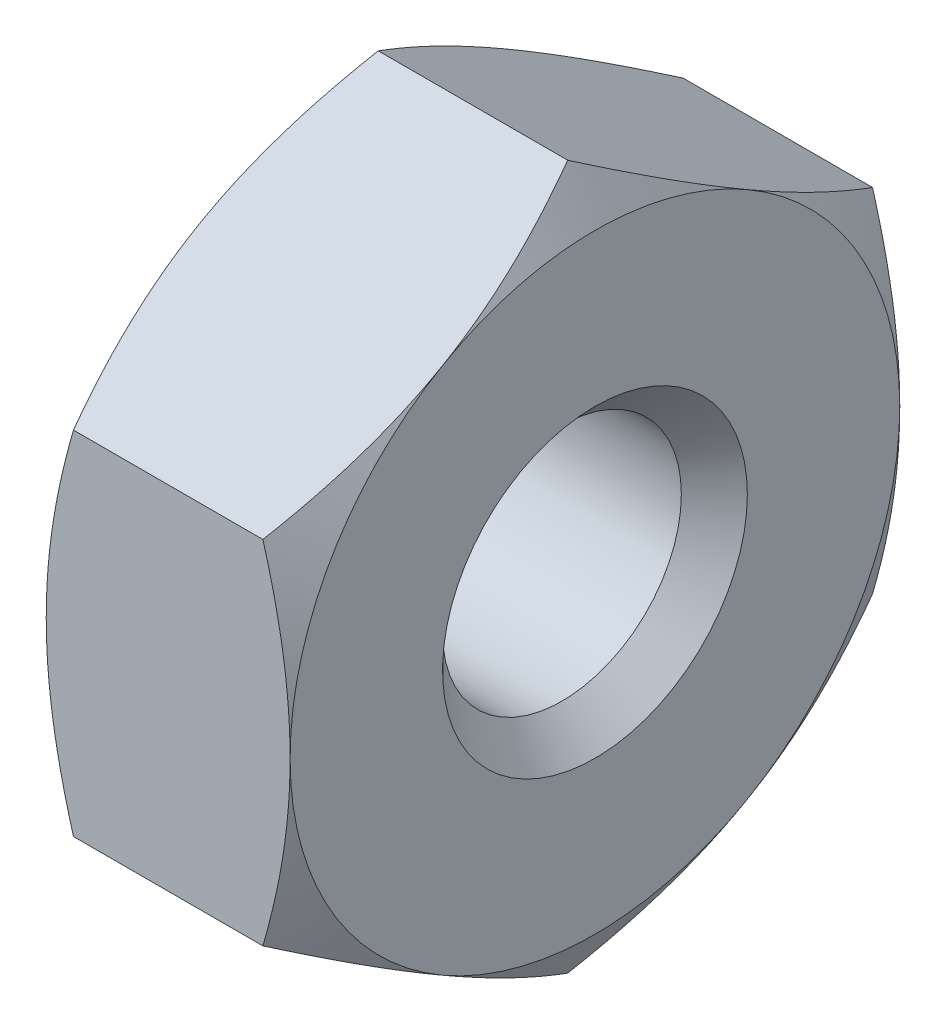
ISO-10303-21;
HEADER;
FILE_DESCRIPTION(('STEP AP214'),'2;1');
FILE_NAME('part.step','',(''),(''),'','','');
FILE_SCHEMA(('AUTOMOTIVE_DESIGN { 1 0 10303 214 1 1 1 1 }'));
ENDSEC;
DATA;
#1=APPLICATION_CONTEXT('core data for automotive mechanical design processes');
#2=APPLICATION_PROTOCOL_DEFINITION('international standard','automotive_design',2000,#1);
#3=PRODUCT_CONTEXT('',#1,'mechanical');
#4=PRODUCT('Part','Part','',(#3));
#5=PRODUCT_RELATED_PRODUCT_CATEGORY('part','',(#4));
#6=PRODUCT_DEFINITION_FORMATION('','',#4);
#7=PRODUCT_DEFINITION_CONTEXT('part definition',#1,'design');
#8=PRODUCT_DEFINITION('design','',#6,#7);
#9=PRODUCT_DEFINITION_SHAPE('','',#8);
#10=(LENGTH_UNIT() NAMED_UNIT(*) SI_UNIT(.MILLI.,.METRE.));
#11=(NAMED_UNIT(*) PLANE_ANGLE_UNIT() SI_UNIT($,.RADIAN.));
#12=(NAMED_UNIT(*) SI_UNIT($,.STERADIAN.) SOLID_ANGLE_UNIT());
#13=UNCERTAINTY_MEASURE_WITH_UNIT(LENGTH_MEASURE(1.E-05),#10,'distance_accuracy_value','');
#14=(GEOMETRIC_REPRESENTATION_CONTEXT(3) GLOBAL_UNCERTAINTY_ASSIGNED_CONTEXT((#13)) GLOBAL_UNIT_ASSIGNED_CONTEXT((#10,
#11,#12)) REPRESENTATION_CONTEXT('',''));
#15=CARTESIAN_POINT('',(0.,0.,0.));
#16=DIRECTION('',(0.,0.,1.));
#17=DIRECTION('',(1.,0.,0.));
#18=AXIS2_PLACEMENT_3D('',#15,#16,#17);
#19=CARTESIAN_POINT('',(0.,1.5,0.));
#20=DIRECTION('',(-1.,0.,0.));
#21=DIRECTION('',(0.,-1.,0.));
#22=AXIS2_PLACEMENT_3D('',#19,#20,#21);
#23=PLANE('',#22);
#24=CARTESIAN_POINT('',(0.,0.,0.));
#25=DIRECTION('',(-1.,0.,0.));
#26=DIRECTION('',(0.,-1.,0.));
#27=AXIS2_PLACEMENT_3D('',#24,#25,#26);
#28=CIRCLE('',#27,1.00000000003765);
#29=CARTESIAN_POINT('',(0.,-1.00000000003765,0.));
#30=VERTEX_POINT('',#29);
#31=EDGE_CURVE('E416',#30,#30,#28,.F.);
#32=ORIENTED_EDGE('',*,*,#31,.T.);
#33=EDGE_LOOP('',(#32));
#34=FACE_BOUND('',#33,.T.);
#35=CARTESIAN_POINT('',(5.68432833355365E-11,0.,0.));
#36=DIRECTION('',(1.,0.,0.));
#37=DIRECTION('',(0.,1.,0.));
#38=AXIS2_PLACEMENT_3D('',#35,#36,#37);
#39=CIRCLE('',#38,2.00000000000955);
#40=CARTESIAN_POINT('',(5.40864243757479E-11,-1.73205080757301,1.00000000000239));
#41=VERTEX_POINT('',#40);
#42=CARTESIAN_POINT('',(5.40865329583293E-11,0.,2.00000000000477));
#43=VERTEX_POINT('',#42);
#44=EDGE_CURVE('E473',#41,#43,#39,.F.);
#45=ORIENTED_EDGE('',*,*,#44,.T.);
#46=CARTESIAN_POINT('',(5.68432833355365E-11,0.,0.));
#47=DIRECTION('',(1.,0.,0.));
#48=DIRECTION('',(0.,1.,0.));
#49=AXIS2_PLACEMENT_3D('',#46,#47,#48);
#50=CIRCLE('',#49,2.00000000000955);
#51=CARTESIAN_POINT('',(5.40866355594554E-11,1.73205080757301,1.00000000000239));
#52=VERTEX_POINT('',#51);
#53=EDGE_CURVE('E469',#43,#52,#50,.F.);
#54=ORIENTED_EDGE('',*,*,#53,.T.);
#55=CARTESIAN_POINT('',(5.68432833355365E-11,0.,0.));
#56=DIRECTION('',(1.,0.,0.));
#57=DIRECTION('',(0.,1.,0.));
#58=AXIS2_PLACEMENT_3D('',#55,#56,#57);
#59=CIRCLE('',#58,2.00000000000955);
#60=CARTESIAN_POINT('',(5.40866985017918E-11,1.73205080757301,-1.00000000000239));
#61=VERTEX_POINT('',#60);
#62=EDGE_CURVE('E488',#52,#61,#59,.F.);
#63=ORIENTED_EDGE('',*,*,#62,.T.);
#64=CARTESIAN_POINT('',(5.68432833355365E-11,0.,0.));
#65=DIRECTION('',(1.,0.,0.));
#66=DIRECTION('',(0.,1.,0.));
#67=AXIS2_PLACEMENT_3D('',#64,#65,#66);
#68=CIRCLE('',#67,2.00000000000955);
#69=CARTESIAN_POINT('',(5.40865282196381E-11,0.,-2.00000000000477));
#70=VERTEX_POINT('',#69);
#71=EDGE_CURVE('E485',#61,#70,#68,.F.);
#72=ORIENTED_EDGE('',*,*,#71,.T.);
#73=CARTESIAN_POINT('',(5.68432833355365E-11,0.,0.));
#74=DIRECTION('',(1.,0.,0.));
#75=DIRECTION('',(0.,1.,0.));
#76=AXIS2_PLACEMENT_3D('',#73,#74,#75);
#77=CIRCLE('',#76,2.00000000000955);
#78=CARTESIAN_POINT('',(5.40865519274302E-11,-1.73205080757301,-1.00000000000239));
#79=VERTEX_POINT('',#78);
#80=EDGE_CURVE('E481',#70,#79,#77,.F.);
#81=ORIENTED_EDGE('',*,*,#80,.T.);
#82=CARTESIAN_POINT('',(5.68435272810253E-11,0.,0.));
#83=DIRECTION('',(1.,0.,0.));
#84=DIRECTION('',(0.,1.,0.));
#85=AXIS2_PLACEMENT_3D('',#82,#83,#84);
#86=CIRCLE('',#85,2.00000000000955);
#87=EDGE_CURVE('E477',#79,#41,#86,.F.);
#88=ORIENTED_EDGE('',*,*,#87,.T.);
#89=EDGE_LOOP('',(#45,#54,#63,#72,#81,#88));
#90=FACE_BOUND('',#89,.T.);
#91=ADVANCED_FACE('F39',(#34,#90),#23,.T.);
#92=CARTESIAN_POINT('',(1.42029540836575,0.,0.));
#93=DIRECTION('',(-1.,0.,0.));
#94=DIRECTION('',(0.,-1.,0.));
#95=AXIS2_PLACEMENT_3D('',#92,#93,#94);
#96=CONICAL_SURFACE('',#95,2.31125748302929,1.04719755114409);
#97=CARTESIAN_POINT('',(1.42136717273602,2.30940105764603,-4.19366556259162E-08));
#98=CARTESIAN_POINT('',(1.44850503570785,2.26239682343145,0.0814137280869873));
#99=CARTESIAN_POINT('',(1.47337109822714,2.21502850917009,0.16345807473593));
#100=CARTESIAN_POINT('',(1.51722218429023,2.11987422349904,0.328270146375747));
#101=CARTESIAN_POINT('',(1.53623628828178,2.07209157171156,0.411032121738395));
#102=CARTESIAN_POINT('',(1.56736213758082,1.97588912682778,0.577659640331214));
#103=CARTESIAN_POINT('',(1.5794661676111,1.9274686830667,0.661526310553393));
#104=CARTESIAN_POINT('',(1.59171459181829,1.8544748396011,0.787955356642342));
#105=CARTESIAN_POINT('',(1.594813089699,1.83001955986848,0.830313143557753));
#106=CARTESIAN_POINT('',(1.59895912186117,1.78106090377824,0.915112023186731));
#107=CARTESIAN_POINT('',(1.60000624995358,1.75655751885665,0.957553130733499));
#108=CARTESIAN_POINT('',(1.60000000000178,1.73205080756888,0.999999999999999));
#109=B_SPLINE_CURVE_WITH_KNOTS('',3,(#97,#98,#99,#100,#101,#102,#103,#104,#105,#106,#107,#108),
.UNSPECIFIED.,.F.,.F.,(4,2,2,2,2,4),(0.,0.29361467279032,0.585745791048545,0.878202446566273,
1.02519002439222,1.17220670409502),.UNSPECIFIED.);
#110=CARTESIAN_POINT('',(1.4213672002185,2.30940108508542,-1.44226404176872E-08));
#111=VERTEX_POINT('',#110);
#112=CARTESIAN_POINT('',(1.59999999999903,1.73205080757301,1.00000000000239));
#113=VERTEX_POINT('',#112);
#114=EDGE_CURVE('E134',#111,#113,#109,.T.);
#115=ORIENTED_EDGE('',*,*,#114,.T.);
#116=CARTESIAN_POINT('',(1.59999999999627,0.,0.));
#117=DIRECTION('',(-1.,0.,0.));
#118=DIRECTION('',(0.,-1.,0.));
#119=AXIS2_PLACEMENT_3D('',#116,#117,#118);
#120=CIRCLE('',#119,2.00000000000955);
#121=CARTESIAN_POINT('',(1.59999999999903,1.73205080757301,-1.00000000000239));
#122=VERTEX_POINT('',#121);
#123=EDGE_CURVE('E137',#122,#113,#120,.F.);
#124=ORIENTED_EDGE('',*,*,#123,.F.);
#125=CARTESIAN_POINT('',(1.60000000000178,1.73205080756888,-1.));
#126=CARTESIAN_POINT('',(1.60000625000865,1.75655751633209,-0.957553135295828));
#127=CARTESIAN_POINT('',(1.59895912211222,1.78106089859575,-0.915112032257883));
#128=CARTESIAN_POINT('',(1.59481309077146,1.83001954941231,-0.830313161573568));
#129=CARTESIAN_POINT('',(1.59171459351375,1.85447482652912,-0.787955379094087));
#130=CARTESIAN_POINT('',(1.57946617200721,1.92746866276138,-0.661526346100448));
#131=CARTESIAN_POINT('',(1.56736214488446,1.97588910233845,-0.57765968462814));
#132=CARTESIAN_POINT('',(1.53623630057477,2.07209153564466,-0.411032182330026));
#133=CARTESIAN_POINT('',(1.5172221986913,2.11987418004411,-0.328270214510187));
#134=CARTESIAN_POINT('',(1.47337112532243,2.21502846264436,-0.163458162488795));
#135=CARTESIAN_POINT('',(1.44850507344965,2.26239678128534,-0.0814138279335024));
#136=CARTESIAN_POINT('',(1.4213672300418,2.30940103342994,-7.5047273832432E-08));
#137=B_SPLINE_CURVE_WITH_KNOTS('',3,(#125,#126,#127,#128,#129,#130,#131,#132,#133,#134,#135,
#136),.UNSPECIFIED.,.F.,.F.,(4,2,2,2,2,4),(0.,0.147016664025122,0.294004226344428,
0.586460851900274,0.878591939162094,1.17220657989707),.UNSPECIFIED.);
#138=EDGE_CURVE('E124',#122,#111,#137,.T.);
#139=ORIENTED_EDGE('',*,*,#138,.T.);
#140=EDGE_LOOP('',(#115,#124,#139));
#141=FACE_BOUND('',#140,.T.);
#142=ADVANCED_FACE('F138',(#141),#96,.T.);
#143=CARTESIAN_POINT('',(1.42029540836575,0.,0.));
#144=DIRECTION('',(-1.,0.,0.));
#145=DIRECTION('',(0.,-1.,0.));
#146=AXIS2_PLACEMENT_3D('',#143,#144,#145);
#147=CONICAL_SURFACE('',#146,2.31125748302929,1.04719755114409);
#148=CARTESIAN_POINT('',(1.59999999999627,0.,0.));
#149=DIRECTION('',(-1.,0.,0.));
#150=DIRECTION('',(0.,-1.,0.));
#151=AXIS2_PLACEMENT_3D('',#148,#149,#150);
#152=CIRCLE('',#151,2.00000000000955);
#153=CARTESIAN_POINT('',(1.59999999999903,0.,2.00000000000477));
#154=VERTEX_POINT('',#153);
#155=CARTESIAN_POINT('',(1.59999999999903,-1.73205080757301,1.00000000000239));
#156=VERTEX_POINT('',#155);
#157=EDGE_CURVE('E145',#154,#156,#152,.F.);
#158=ORIENTED_EDGE('',*,*,#157,.F.);
#159=CARTESIAN_POINT('',(1.60000000000178,0.,2.));
#160=CARTESIAN_POINT('',(1.60000625001118,-0.0490134224920728,2.));
#161=CARTESIAN_POINT('',(1.5989591219012,-0.0980201919829409,2.));
#162=CARTESIAN_POINT('',(1.59481308972341,-0.195937503512387,2.));
#163=CARTESIAN_POINT('',(1.59171459184245,-0.244848062678778,2.));
#164=CARTESIAN_POINT('',(1.57946616789877,-0.39083574974992,2.));
#165=CARTESIAN_POINT('',(1.56736213839411,-0.487676638507895,2.));
#166=CARTESIAN_POINT('',(1.53623628816846,-0.680081523974915,2.));
#167=CARTESIAN_POINT('',(1.51722218275463,-0.775646822025329,2.));
#168=CARTESIAN_POINT('',(1.47337110150568,-0.965955405557248,2.));
#169=CARTESIAN_POINT('',(1.44850504527506,-1.06069205191672,2.));
#170=CARTESIAN_POINT('',(1.42136719729834,-1.15470056514878,2.));
#171=B_SPLINE_CURVE_WITH_KNOTS('',3,(#159,#160,#161,#162,#163,#164,#165,#166,#167,#168,#169,
#170),.UNSPECIFIED.,.F.,.F.,(4,2,2,2,2,4),(0.,0.147016678914887,0.294004256109472,
0.586460911052757,0.878592027567199,1.17220669791303),.UNSPECIFIED.);
#172=CARTESIAN_POINT('',(1.42136721753498,-1.15470056004537,1.99999996247318));
#173=VERTEX_POINT('',#172);
#174=EDGE_CURVE('E381',#154,#173,#171,.T.);
#175=ORIENTED_EDGE('',*,*,#174,.T.);
#176=CARTESIAN_POINT('',(1.42136723004322,-1.15470058171059,1.9999999249456));
#177=CARTESIAN_POINT('',(1.44850507345124,-1.20170483385549,1.91858617206034));
#178=CARTESIAN_POINT('',(1.47337112532391,-1.24907315249642,1.83654183750575));
#179=CARTESIAN_POINT('',(1.51722219869241,-1.34422743509625,1.67172978548552));
#180=CARTESIAN_POINT('',(1.5362363005756,-1.39201007949534,1.58896781766614));
#181=CARTESIAN_POINT('',(1.56736214488487,-1.48821251280088,1.42234031536906));
#182=CARTESIAN_POINT('',(1.57946617200747,-1.53663295237766,1.33847365389732));
#183=CARTESIAN_POINT('',(1.59171459351386,-1.60962678860945,1.21204462090452));
#184=CARTESIAN_POINT('',(1.59481309077153,-1.63408206572609,1.16968683842532));
#185=CARTESIAN_POINT('',(1.59895912211223,-1.68304071654233,1.08488796774156));
#186=CARTESIAN_POINT('',(1.60000625000865,-1.70754409880583,1.04244686470389));
#187=CARTESIAN_POINT('',(1.60000000000178,-1.73205080756888,1.));
#188=B_SPLINE_CURVE_WITH_KNOTS('',3,(#176,#177,#178,#179,#180,#181,#182,#183,#184,#185,#186,
#187),.UNSPECIFIED.,.F.,.F.,(4,2,2,2,2,4),(0.,0.29361464073308,0.585745727993005,
0.878202353546911,1.02518991586524,1.1722065798894),.UNSPECIFIED.);
#189=EDGE_CURVE('E390',#173,#156,#188,.T.);
#190=ORIENTED_EDGE('',*,*,#189,.T.);
#191=EDGE_LOOP('',(#158,#175,#190));
#192=FACE_BOUND('',#191,.T.);
#193=ADVANCED_FACE('F329',(#192),#147,.T.);
#194=CARTESIAN_POINT('',(1.42029540836575,0.,0.));
#195=DIRECTION('',(-1.,0.,0.));
#196=DIRECTION('',(0.,-1.,0.));
#197=AXIS2_PLACEMENT_3D('',#194,#195,#196);
#198=CONICAL_SURFACE('',#197,2.31125748302929,1.04719755114409);
#199=CARTESIAN_POINT('',(1.59999999999627,0.,0.));
#200=DIRECTION('',(-1.,0.,0.));
#201=DIRECTION('',(0.,-1.,0.));
#202=AXIS2_PLACEMENT_3D('',#199,#200,#201);
#203=CIRCLE('',#202,2.00000000000955);
#204=CARTESIAN_POINT('',(1.59999999999903,-1.73205080757301,-1.00000000000239));
#205=VERTEX_POINT('',#204);
#206=EDGE_CURVE('E168',#156,#205,#203,.F.);
#207=ORIENTED_EDGE('',*,*,#206,.F.);
#208=CARTESIAN_POINT('',(1.60000000000178,-1.73205080756888,1.));
#209=CARTESIAN_POINT('',(1.60000625000991,-1.75655751757342,0.957553133145779));
#210=CARTESIAN_POINT('',(1.59895912200671,-1.78106090107788,0.9151120279587));
#211=CARTESIAN_POINT('',(1.59481309024747,-1.83001955436836,0.83031315298944));
#212=CARTESIAN_POINT('',(1.59171459267815,-1.85447483271828,0.787955368374144));
#213=CARTESIAN_POINT('',(1.57946616995313,-1.92746867260195,0.661526329056075));
#214=CARTESIAN_POINT('',(1.5673621416395,-1.97588911457982,0.577659663425463));
#215=CARTESIAN_POINT('',(1.53623629437203,-2.07209155259937,0.411032152963612));
#216=CARTESIAN_POINT('',(1.5172221907235,-2.11987419931154,0.328270181138014));
#217=CARTESIAN_POINT('',(1.47337111341484,-2.21502848649434,0.16345812117941));
#218=CARTESIAN_POINT('',(1.44850505936329,-2.26239680740455,0.081413782693701));
#219=CARTESIAN_POINT('',(1.42136721367116,-2.30940106178472,2.59353592177843E-08));
#220=B_SPLINE_CURVE_WITH_KNOTS('',3,(#208,#209,#210,#211,#212,#213,#214,#215,#216,#217,#218,
#219),.UNSPECIFIED.,.F.,.F.,(4,2,2,2,2,4),(0.,0.147016671469509,0.294004241225959,
0.586460881474546,0.878591983361704,1.17220663890112),.UNSPECIFIED.);
#221=CARTESIAN_POINT('',(1.42136720887616,-2.3094010700899,-1.15503587280333E-08));
#222=VERTEX_POINT('',#221);
#223=EDGE_CURVE('E223',#156,#222,#220,.T.);
#224=ORIENTED_EDGE('',*,*,#223,.T.);
#225=CARTESIAN_POINT('',(1.42136720138771,-2.30940104553641,-1.65543929493996E-08));
#226=CARTESIAN_POINT('',(1.44850505457829,-2.2623968023579,-0.0814137780097863));
#227=CARTESIAN_POINT('',(1.47337111177462,-2.21502848590717,-0.16345811861211));
#228=CARTESIAN_POINT('',(1.51722219149084,-2.11987420177182,-0.328270180442897));
#229=CARTESIAN_POINT('',(1.53623629442828,-2.07209155367822,-0.411032152034118));
#230=CARTESIAN_POINT('',(1.5673621412326,-1.97588911458312,-0.577659662479584));
#231=CARTESIAN_POINT('',(1.57946616980914,-1.92746867291407,-0.661526328326848));
#232=CARTESIAN_POINT('',(1.59171459266602,-1.85447483306514,-0.787955367868165));
#233=CARTESIAN_POINT('',(1.59481309023523,-1.83001955464043,-0.830313152565618));
#234=CARTESIAN_POINT('',(1.59895912198669,-1.781060901187,-0.915112027722284));
#235=CARTESIAN_POINT('',(1.60000624998111,-1.75655751759437,-0.95755313301465));
#236=CARTESIAN_POINT('',(1.60000000000178,-1.73205080756888,-1.));
#237=B_SPLINE_CURVE_WITH_KNOTS('',3,(#225,#226,#227,#228,#229,#230,#231,#232,#233,#234,#235,
#236),.UNSPECIFIED.,.F.,.F.,(4,2,2,2,2,4),(0.,0.293614656762768,0.585745759522877,
0.878202400059693,1.02518997013235,1.17220664199635),.UNSPECIFIED.);
#238=EDGE_CURVE('E389',#222,#205,#237,.T.);
#239=ORIENTED_EDGE('',*,*,#238,.T.);
#240=EDGE_LOOP('',(#207,#224,#239));
#241=FACE_BOUND('',#240,.T.);
#242=ADVANCED_FACE('F203',(#241),#198,.T.);
#243=CARTESIAN_POINT('',(1.42029540836575,0.,0.));
#244=DIRECTION('',(-1.,0.,0.));
#245=DIRECTION('',(0.,-1.,0.));
#246=AXIS2_PLACEMENT_3D('',#243,#244,#245);
#247=CONICAL_SURFACE('',#246,2.31125748302929,1.04719755114409);
#248=CARTESIAN_POINT('',(1.59999999999627,0.,0.));
#249=DIRECTION('',(-1.,0.,0.));
#250=DIRECTION('',(0.,-1.,0.));
#251=AXIS2_PLACEMENT_3D('',#248,#249,#250);
#252=CIRCLE('',#251,2.00000000000955);
#253=CARTESIAN_POINT('',(1.59999999999903,0.,-2.00000000000477));
#254=VERTEX_POINT('',#253);
#255=EDGE_CURVE('E159',#205,#254,#252,.F.);
#256=ORIENTED_EDGE('',*,*,#255,.F.);
#257=CARTESIAN_POINT('',(1.60000000000178,-1.73205080756888,-1.));
#258=CARTESIAN_POINT('',(1.60000625001118,-1.70754409632327,-1.04244686900381));
#259=CARTESIAN_POINT('',(1.59895912190123,-1.68304071157827,-1.08488797633956));
#260=CARTESIAN_POINT('',(1.59481308972359,-1.63408205581441,-1.16968685559285));
#261=CARTESIAN_POINT('',(1.59171459184274,-1.60962677623164,-1.2120446423435));
#262=CARTESIAN_POINT('',(1.57946616789948,-1.53663293269734,-1.33847368798465));
#263=CARTESIAN_POINT('',(1.56736213839524,-1.48821248831918,-1.42234035777267));
#264=CARTESIAN_POINT('',(1.53623628817061,-1.39201004558731,-1.58896787639651));
#265=CARTESIAN_POINT('',(1.5172221827574,-1.34422739656291,-1.67172985222701));
#266=CARTESIAN_POINT('',(1.47337110150981,-1.24907310479854,-1.83654192012112));
#267=CARTESIAN_POINT('',(1.44850504527995,-1.20170478161959,-1.9185862625364));
#268=CARTESIAN_POINT('',(1.42136719730403,-1.15470052500434,-2.00000002316603));
#269=B_SPLINE_CURVE_WITH_KNOTS('',3,(#257,#258,#259,#260,#261,#262,#263,#264,#265,#266,#267,
#268),.UNSPECIFIED.,.F.,.F.,(4,2,2,2,2,4),(0.,0.1470166789123,0.294004256104301,
0.586460911042481,0.878592027551841,1.17220669789252),.UNSPECIFIED.);
#270=CARTESIAN_POINT('',(1.42136721753197,-1.15470049505743,-2.));
#271=VERTEX_POINT('',#270);
#272=EDGE_CURVE('E208',#205,#271,#269,.T.);
#273=ORIENTED_EDGE('',*,*,#272,.T.);
#274=CARTESIAN_POINT('',(1.42136723003327,-1.15470045173427,-1.99999999999232));
#275=CARTESIAN_POINT('',(1.44850507344468,-1.06069194744473,-1.99999999999725));
#276=CARTESIAN_POINT('',(1.4733711253192,-0.965955310161961,-1.99999999999927));
#277=CARTESIAN_POINT('',(1.5172221986899,-0.775646744959468,-2.00000000000073));
#278=CARTESIAN_POINT('',(1.53623630057347,-0.680081456159383,-2.00000000000019));
#279=CARTESIAN_POINT('',(1.5673621448836,-0.487676589544728,-1.99999999999981));
#280=CARTESIAN_POINT('',(1.57946617200671,-0.390835710389542,-1.99999999999996));
#281=CARTESIAN_POINT('',(1.59171459351356,-0.244848037923383,-2.00000000000002));
#282=CARTESIAN_POINT('',(1.59481309077134,-0.195937483689203,-2.00000000000001));
#283=CARTESIAN_POINT('',(1.59895912211219,-0.0980201820549125,-1.99999999999999));
#284=CARTESIAN_POINT('',(1.60000625000864,-0.0490134175270015,-1.99999999999998));
#285=CARTESIAN_POINT('',(1.60000000000178,0.,-2.));
#286=B_SPLINE_CURVE_WITH_KNOTS('',3,(#274,#275,#276,#277,#278,#279,#280,#281,#282,#283,#284,
#285),.UNSPECIFIED.,.F.,.F.,(4,2,2,2,2,4),(0.,0.29361464073865,0.585745728003959,
0.87820235356307,1.0251899158841,1.17220657991098),.UNSPECIFIED.);
#287=EDGE_CURVE('E215',#271,#254,#286,.T.);
#288=ORIENTED_EDGE('',*,*,#287,.T.);
#289=EDGE_LOOP('',(#256,#273,#288));
#290=FACE_BOUND('',#289,.T.);
#291=ADVANCED_FACE('F198',(#290),#247,.T.);
#292=CARTESIAN_POINT('',(1.42029540836575,0.,0.));
#293=DIRECTION('',(-1.,0.,0.));
#294=DIRECTION('',(0.,-1.,0.));
#295=AXIS2_PLACEMENT_3D('',#292,#293,#294);
#296=CONICAL_SURFACE('',#295,2.31125748302929,1.04719755114409);
#297=CARTESIAN_POINT('',(1.42136717273419,1.15470049250196,-2.00000000441898));
#298=CARTESIAN_POINT('',(1.44850503570665,1.20170476845377,-1.91858625849212));
#299=CARTESIAN_POINT('',(1.47337109822628,1.24907309975837,-1.8365419216828));
#300=CARTESIAN_POINT('',(1.51722218428977,1.34422739781376,-1.6717298571924));
#301=CARTESIAN_POINT('',(1.53623628828139,1.39201004505155,-1.5889678792026));
#302=CARTESIAN_POINT('',(1.56736213758058,1.48821248668087,-1.42234035873009));
#303=CARTESIAN_POINT('',(1.57946616761096,1.53663293174372,-1.33847368925913));
#304=CARTESIAN_POINT('',(1.59171459181823,1.60962677570043,-1.21204464345317));
#305=CARTESIAN_POINT('',(1.59481308969897,1.63408205535104,-1.16968685649022));
#306=CARTESIAN_POINT('',(1.59895912186116,1.68304071127723,-1.08488797676615));
#307=CARTESIAN_POINT('',(1.60000624995357,1.70754409611677,-1.04244686917181));
#308=CARTESIAN_POINT('',(1.60000000000178,1.73205080756888,-1.));
#309=B_SPLINE_CURVE_WITH_KNOTS('',3,(#297,#298,#299,#300,#301,#302,#303,#304,#305,#306,#307,
#308),.UNSPECIFIED.,.F.,.F.,(4,2,2,2,2,4),(0.,0.293614672791344,0.585745791050559,
0.878202446569244,1.02519002439569,1.17220670409898),.UNSPECIFIED.);
#310=CARTESIAN_POINT('',(1.42136720021794,1.15470053005138,-2.0000000144243));
#311=VERTEX_POINT('',#310);
#312=EDGE_CURVE('E129',#311,#122,#309,.T.);
#313=ORIENTED_EDGE('',*,*,#312,.T.);
#314=CARTESIAN_POINT('',(1.59999999999627,0.,0.));
#315=DIRECTION('',(-1.,0.,0.));
#316=DIRECTION('',(0.,-1.,0.));
#317=AXIS2_PLACEMENT_3D('',#314,#315,#316);
#318=CIRCLE('',#317,2.00000000000955);
#319=EDGE_CURVE('E151',#254,#122,#318,.F.);
#320=ORIENTED_EDGE('',*,*,#319,.F.);
#321=CARTESIAN_POINT('',(1.60000000000178,0.,-2.));
#322=CARTESIAN_POINT('',(1.60000625000865,0.0490134175262608,-2.));
#323=CARTESIAN_POINT('',(1.59895912211222,0.0980201820534265,-2.));
#324=CARTESIAN_POINT('',(1.59481309077149,0.195937483686242,-2.));
#325=CARTESIAN_POINT('',(1.5917145935138,0.244848037919691,-2.));
#326=CARTESIAN_POINT('',(1.57946617200734,0.390835710383748,-2.));
#327=CARTESIAN_POINT('',(1.56736214488467,0.487676589537586,-2.));
#328=CARTESIAN_POINT('',(1.53623630057517,0.680081456149406,-2.));
#329=CARTESIAN_POINT('',(1.51722219869181,0.775646744948005,-2.));
#330=CARTESIAN_POINT('',(1.47337112532319,0.96595531014791,-2.));
#331=CARTESIAN_POINT('',(1.44850507345055,1.06069194742958,-2.));
#332=CARTESIAN_POINT('',(1.42136723004285,1.1547004517185,-2.));
#333=B_SPLINE_CURVE_WITH_KNOTS('',3,(#321,#322,#323,#324,#325,#326,#327,#328,#329,#330,#331,
#332),.UNSPECIFIED.,.F.,.F.,(4,2,2,2,2,4),(0.,0.147016664024646,0.294004226343477,
0.586460851898385,0.878591939159272,1.1722065798933),.UNSPECIFIED.);
#334=EDGE_CURVE('E153',#254,#311,#333,.T.);
#335=ORIENTED_EDGE('',*,*,#334,.T.);
#336=EDGE_LOOP('',(#313,#320,#335));
#337=FACE_BOUND('',#336,.T.);
#338=ADVANCED_FACE('F150',(#337),#296,.T.);
#339=CARTESIAN_POINT('',(1.6,1.5,0.));
#340=DIRECTION('',(1.,0.,0.));
#341=DIRECTION('',(0.,1.,0.));
#342=AXIS2_PLACEMENT_3D('',#339,#340,#341);
#343=PLANE('',#342);
#344=CARTESIAN_POINT('',(1.6,0.,0.));
#345=DIRECTION('',(1.,0.,0.));
#346=DIRECTION('',(0.,1.,0.));
#347=AXIS2_PLACEMENT_3D('',#344,#345,#346);
#348=CIRCLE('',#347,0.999999999986326);
#349=CARTESIAN_POINT('',(1.6,0.999999999986326,0.));
#350=VERTEX_POINT('',#349);
#351=EDGE_CURVE('E12',#350,#350,#348,.F.);
#352=ORIENTED_EDGE('',*,*,#351,.T.);
#353=EDGE_LOOP('',(#352));
#354=FACE_BOUND('',#353,.T.);
#355=ORIENTED_EDGE('',*,*,#255,.T.);
#356=ORIENTED_EDGE('',*,*,#319,.T.);
#357=ORIENTED_EDGE('',*,*,#123,.T.);
#358=CARTESIAN_POINT('',(1.59999999999627,0.,0.));
#359=DIRECTION('',(-1.,0.,0.));
#360=DIRECTION('',(0.,-1.,0.));
#361=AXIS2_PLACEMENT_3D('',#358,#359,#360);
#362=CIRCLE('',#361,2.00000000000955);
#363=EDGE_CURVE('E161',#154,#113,#362,.T.);
#364=ORIENTED_EDGE('',*,*,#363,.F.);
#365=ORIENTED_EDGE('',*,*,#157,.T.);
#366=ORIENTED_EDGE('',*,*,#206,.T.);
#367=EDGE_LOOP('',(#355,#356,#357,#364,#365,#366));
#368=FACE_BOUND('',#367,.T.);
#369=ADVANCED_FACE('F156',(#354,#368),#343,.T.);
#370=CARTESIAN_POINT('',(1.42029540836575,0.,0.));
#371=DIRECTION('',(-1.,0.,0.));
#372=DIRECTION('',(0.,-1.,0.));
#373=AXIS2_PLACEMENT_3D('',#370,#371,#372);
#374=CONICAL_SURFACE('',#373,2.31125748302929,1.04719755114409);
#375=CARTESIAN_POINT('',(1.42136720502757,1.15470053837396,2.));
#376=CARTESIAN_POINT('',(1.44850505192579,1.06069202725289,2.));
#377=CARTESIAN_POINT('',(1.47337110712772,0.965955383036201,2.));
#378=CARTESIAN_POINT('',(1.51722218651655,0.775646803831491,2.));
#379=CARTESIAN_POINT('',(1.53623629109702,0.680081507964936,2.));
#380=CARTESIAN_POINT('',(1.56736213992619,0.487676626948621,2.));
#381=CARTESIAN_POINT('',(1.57946616886858,0.39083574045767,2.));
#382=CARTESIAN_POINT('',(1.59171459223696,0.24484805683448,2.));
#383=CARTESIAN_POINT('',(1.5948130899708,0.195937498832494,2.));
#384=CARTESIAN_POINT('',(1.59895912195101,0.0980201896391128,2.));
#385=CARTESIAN_POINT('',(1.60000625001058,0.0490134213199096,2.));
#386=CARTESIAN_POINT('',(1.60000000000178,0.,2.));
#387=B_SPLINE_CURVE_WITH_KNOTS('',3,(#375,#376,#377,#378,#379,#380,#381,#382,#383,#384,#385,
#386),.UNSPECIFIED.,.F.,.F.,(4,2,2,2,2,4),(0.,0.293614663356064,0.585745772965305,
0.878202420971565,1.02518999465478,1.17220667005488),.UNSPECIFIED.);
#388=CARTESIAN_POINT('',(1.42136720502757,1.15470053837793,1.99999999999771));
#389=VERTEX_POINT('',#388);
#390=EDGE_CURVE('E305',#389,#154,#387,.T.);
#391=ORIENTED_EDGE('',*,*,#390,.T.);
#392=ORIENTED_EDGE('',*,*,#363,.T.);
#393=CARTESIAN_POINT('',(1.60000000000178,1.73205080756888,1.));
#394=CARTESIAN_POINT('',(1.60000625001058,1.70754409690892,1.04244686798943));
#395=CARTESIAN_POINT('',(1.59895912195101,1.68304071274932,1.08488797431124));
#396=CARTESIAN_POINT('',(1.5948130899708,1.63408205815263,1.16968685154292));
#397=CARTESIAN_POINT('',(1.59171459223696,1.60962677915164,1.21204463728592));
#398=CARTESIAN_POINT('',(1.57946616886858,1.53663293734004,1.33847367994324));
#399=CARTESIAN_POINT('',(1.56736213992619,1.48821249409457,1.42234034776941));
#400=CARTESIAN_POINT('',(1.53623629109702,1.39201005358641,1.58896786254166));
#401=CARTESIAN_POINT('',(1.51722218651655,1.34422740565313,1.67172983648228));
#402=CARTESIAN_POINT('',(1.47337110712772,1.24907311605078,1.83654190063168));
#403=CARTESIAN_POINT('',(1.44850505192579,1.20170479394243,1.91858624119262));
#404=CARTESIAN_POINT('',(1.42136720502757,1.1547005383819,1.99999999999541));
#405=B_SPLINE_CURVE_WITH_KNOTS('',3,(#393,#394,#395,#396,#397,#398,#399,#400,#401,#402,#403,
#404),.UNSPECIFIED.,.F.,.F.,(4,2,2,2,2,4),(0.,0.147016675400097,0.294004249083311,
0.586460897089571,0.878592006698811,1.17220667005488),.UNSPECIFIED.);
#406=EDGE_CURVE('E299',#113,#389,#405,.T.);
#407=ORIENTED_EDGE('',*,*,#406,.T.);
#408=EDGE_LOOP('',(#391,#392,#407));
#409=FACE_BOUND('',#408,.T.);
#410=ADVANCED_FACE('F311',(#409),#374,.T.);
#411=CARTESIAN_POINT('',(2.6,2.3094010767585,0.));
#412=DIRECTION('',(0.,-0.866025403784439,0.5));
#413=DIRECTION('',(0.,-0.5,-0.866025403784439));
#414=AXIS2_PLACEMENT_3D('',#411,#412,#413);
#415=PLANE('',#414);
#416=CARTESIAN_POINT('',(0.178632798647516,2.30940104554494,-1.65639812387284E-08));
#417=CARTESIAN_POINT('',(0.151494945463243,2.26239680235922,-0.0814137780162253));
#418=CARTESIAN_POINT('',(0.126628888270292,2.21502848590568,-0.163458118617017));
#419=CARTESIAN_POINT('',(0.0827778085580381,2.11987420176857,-0.328270180446202));
#420=CARTESIAN_POINT('',(0.0637637056211892,2.072091553676,-0.411032152037348));
#421=CARTESIAN_POINT('',(0.0326378588183366,1.97588911458193,-0.577659662482251));
#422=CARTESIAN_POINT('',(0.0205338302426661,1.92746867291288,-0.661526328329029));
#423=CARTESIAN_POINT('',(0.00828540738659768,1.85447483306427,-0.787955367869614));
#424=CARTESIAN_POINT('',(0.00518690981756745,1.83001955463973,-0.830313152566796));
#425=CARTESIAN_POINT('',(0.00104087806634947,1.78106090118667,-0.915112027722894));
#426=CARTESIAN_POINT('',(-6.24992801348041E-06,1.75655751759422,-0.957553133014964));
#427=CARTESIAN_POINT('',(5.13298869128508E-11,1.73205080756888,-1.));
#428=B_SPLINE_CURVE_WITH_KNOTS('',3,(#416,#417,#418,#419,#420,#421,#422,#423,#424,#425,#426,
#427),.UNSPECIFIED.,.F.,.F.,(4,2,2,2,2,4),(0.,0.293614656760446,0.585745759518611,
0.878202400053826,1.0251899701255,1.17220664198845),.UNSPECIFIED.);
#429=CARTESIAN_POINT('',(0.178632791167322,2.30940107008836,-1.15530273089503E-08));
#430=VERTEX_POINT('',#429);
#431=EDGE_CURVE('E261',#430,#61,#428,.T.);
#432=ORIENTED_EDGE('',*,*,#431,.F.);
#433=DIRECTION('',(1.,0.,0.));
#434=VECTOR('',#433,1.);
#435=CARTESIAN_POINT('',(2.6,2.3094010767585,0.));
#436=LINE('',#435,#434);
#437=EDGE_CURVE('E131',#430,#111,#436,.T.);
#438=ORIENTED_EDGE('',*,*,#437,.T.);
#439=ORIENTED_EDGE('',*,*,#138,.F.);
#440=ORIENTED_EDGE('',*,*,#312,.F.);
#441=DIRECTION('',(1.,0.,0.));
#442=VECTOR('',#441,1.);
#443=CARTESIAN_POINT('',(2.6,1.15470053837925,-2.));
#444=LINE('',#443,#442);
#445=CARTESIAN_POINT('',(0.178632782503788,1.1547004950276,-2.));
#446=VERTEX_POINT('',#445);
#447=EDGE_CURVE('E166',#311,#446,#444,.F.);
#448=ORIENTED_EDGE('',*,*,#447,.T.);
#449=CARTESIAN_POINT('',(5.13300114139445E-11,1.73205080756888,-1.));
#450=CARTESIAN_POINT('',(-6.24995806087892E-06,1.70754409632328,-1.04244686900379));
#451=CARTESIAN_POINT('',(0.00104087815182792,1.68304071157829,-1.08488797633952));
#452=CARTESIAN_POINT('',(0.00518691032926749,1.63408205581445,-1.16968685559277));
#453=CARTESIAN_POINT('',(0.0082854082099652,1.60962677623169,-1.21204464234342));
#454=CARTESIAN_POINT('',(0.0205338321526164,1.53663293269737,-1.33847368798459));
#455=CARTESIAN_POINT('',(0.0326378616562721,1.48821248831919,-1.42234035777267));
#456=CARTESIAN_POINT('',(0.0637637118794234,1.39201004558719,-1.58896787639672));
#457=CARTESIAN_POINT('',(0.0827778172917478,1.34422739656269,-1.67172985222738));
#458=CARTESIAN_POINT('',(0.126628898537319,1.24907310479811,-1.83654192012188));
#459=CARTESIAN_POINT('',(0.151494954766049,1.20170478161903,-1.91858626253738));
#460=CARTESIAN_POINT('',(0.178632802740759,1.15470052500361,-2.00000002316728));
#461=B_SPLINE_CURVE_WITH_KNOTS('',3,(#449,#450,#451,#452,#453,#454,#455,#456,#457,#458,#459,
#460),.UNSPECIFIED.,.F.,.F.,(4,2,2,2,2,4),(0.,0.147016678912231,0.294004256104167,
0.586460911042353,0.878592027551751,1.17220669789234),.UNSPECIFIED.);
#462=EDGE_CURVE('E260',#61,#446,#461,.T.);
#463=ORIENTED_EDGE('',*,*,#462,.F.);
#464=EDGE_LOOP('',(#432,#438,#439,#440,#448,#463));
#465=FACE_BOUND('',#464,.T.);
#466=ADVANCED_FACE('F127',(#465),#415,.F.);
#467=CARTESIAN_POINT('',(2.6,1.15470053837925,-2.));
#468=DIRECTION('',(0.,0.,1.));
#469=DIRECTION('',(1.,0.,0.));
#470=AXIS2_PLACEMENT_3D('',#467,#468,#469);
#471=PLANE('',#470);
#472=CARTESIAN_POINT('',(0.178632769989803,1.1547004516758,-1.99999999999908));
#473=CARTESIAN_POINT('',(0.151494926584714,1.06069194739012,-1.99999999999967));
#474=CARTESIAN_POINT('',(0.126628874714756,0.965955310111738,-1.99999999999991));
#475=CARTESIAN_POINT('',(0.0827778013511019,0.775646744918523,-2.00000000000009));
#476=CARTESIAN_POINT('',(0.0637636994700344,0.680081456123317,-2.00000000000002));
#477=CARTESIAN_POINT('',(0.0326378551643377,0.487676589518561,-1.99999999999998));
#478=CARTESIAN_POINT('',(0.0205338280431683,0.390835710368395,-2.));
#479=CARTESIAN_POINT('',(0.00828540653825121,0.244848037909986,-2.));
#480=CARTESIAN_POINT('',(0.00518690928095574,0.195937483678465,-2.));
#481=CARTESIAN_POINT('',(0.0010408779407584,0.0980201820495265,-2.));
#482=CARTESIAN_POINT('',(-6.24995553260627E-06,0.0490134175243094,-2.));
#483=CARTESIAN_POINT('',(5.13297731037398E-11,0.,-2.));
#484=B_SPLINE_CURVE_WITH_KNOTS('',3,(#472,#473,#474,#475,#476,#477,#478,#479,#480,#481,#482,
#483),.UNSPECIFIED.,.F.,.F.,(4,2,2,2,2,4),(0.,0.29361464072247,0.58574572797205,
0.878202353515539,1.02518991582853,1.17220657984733),.UNSPECIFIED.);
#485=EDGE_CURVE('E250',#446,#70,#484,.T.);
#486=ORIENTED_EDGE('',*,*,#485,.F.);
#487=ORIENTED_EDGE('',*,*,#447,.F.);
#488=ORIENTED_EDGE('',*,*,#334,.F.);
#489=ORIENTED_EDGE('',*,*,#287,.F.);
#490=DIRECTION('',(1.,0.,0.));
#491=VECTOR('',#490,1.);
#492=CARTESIAN_POINT('',(2.6,-1.15470053837925,-2.));
#493=LINE('',#492,#491);
#494=CARTESIAN_POINT('',(0.178632782508503,-1.15470056004691,-1.99999996247052));
#495=VERTEX_POINT('',#494);
#496=EDGE_CURVE('E464',#271,#495,#493,.F.);
#497=ORIENTED_EDGE('',*,*,#496,.T.);
#498=CARTESIAN_POINT('',(5.13297825811221E-11,0.,-2.));
#499=CARTESIAN_POINT('',(-6.24995806124755E-06,-0.049013422491808,-2.));
#500=CARTESIAN_POINT('',(0.00104087815185431,-0.0980201919824123,-2.));
#501=CARTESIAN_POINT('',(0.00518691032939862,-0.195937503511342,-2.));
#502=CARTESIAN_POINT('',(0.00828540821017427,-0.24484806267748,-2.));
#503=CARTESIAN_POINT('',(0.0205338321531305,-0.390835749747943,-2.));
#504=CARTESIAN_POINT('',(0.0326378616570845,-0.487676638505517,-2.));
#505=CARTESIAN_POINT('',(0.0637637118809767,-0.680081523971873,-2.));
#506=CARTESIAN_POINT('',(0.0827778172937431,-0.775646822022022,-2.));
#507=CARTESIAN_POINT('',(0.126628898540301,-0.965955405553491,-2.));
#508=CARTESIAN_POINT('',(0.151494954769577,-1.06069205191278,-2.));
#509=CARTESIAN_POINT('',(0.178632802744859,-1.15470056514473,-2.));
#510=B_SPLINE_CURVE_WITH_KNOTS('',3,(#498,#499,#500,#501,#502,#503,#504,#505,#506,#507,#508,
#509),.UNSPECIFIED.,.F.,.F.,(4,2,2,2,2,4),(0.,0.147016678914096,0.294004256107894,
0.58646091104976,0.878592027562821,1.17220669790711),.UNSPECIFIED.);
#511=EDGE_CURVE('E240',#70,#495,#510,.T.);
#512=ORIENTED_EDGE('',*,*,#511,.F.);
#513=EDGE_LOOP('',(#486,#487,#488,#489,#497,#512));
#514=FACE_BOUND('',#513,.T.);
#515=ADVANCED_FACE('F231',(#514),#471,.F.);
#516=CARTESIAN_POINT('',(2.6,-1.15470053837925,-2.));
#517=DIRECTION('',(0.,0.866025403784439,0.5));
#518=DIRECTION('',(0.,-0.5,0.866025403784439));
#519=AXIS2_PLACEMENT_3D('',#516,#517,#518);
#520=PLANE('',#519);
#521=CARTESIAN_POINT('',(0.178632769992016,-1.15470058172315,-1.99999992494821));
#522=CARTESIAN_POINT('',(0.1514949265903,-1.20170483386172,-1.91858617205828));
#523=CARTESIAN_POINT('',(0.126628874721008,-1.24907315249992,-1.83654183750202));
#524=CARTESIAN_POINT('',(0.0827778013564725,-1.34422743509749,-1.67172978548107));
#525=CARTESIAN_POINT('',(0.0637636994738707,-1.39201007949702,-1.58896781766262));
#526=CARTESIAN_POINT('',(0.0326378551660669,-1.4882125128026,-1.42234031536671));
#527=CARTESIAN_POINT('',(0.0205338280443354,-1.53663295237895,-1.3384736538952));
#528=CARTESIAN_POINT('',(0.00828540653875545,-1.60962678861026,-1.21204462090304));
#529=CARTESIAN_POINT('',(0.00518690928126885,-1.63408206572676,-1.16968683842412));
#530=CARTESIAN_POINT('',(0.00104087794081002,-1.68304071654269,-1.08488796774096));
#531=CARTESIAN_POINT('',(-6.24995555200905E-06,-1.70754409880603,-1.04244686470361));
#532=CARTESIAN_POINT('',(5.13296121237146E-11,-1.73205080756888,-1.));
#533=B_SPLINE_CURVE_WITH_KNOTS('',3,(#521,#522,#523,#524,#525,#526,#527,#528,#529,#530,#531,
#532),.UNSPECIFIED.,.F.,.F.,(4,2,2,2,2,4),(0.,0.293614640730762,0.585745727988749,
0.878202353541058,1.0251899158584,1.17220657988152),.UNSPECIFIED.);
#534=EDGE_CURVE('E431',#495,#79,#533,.T.);
#535=ORIENTED_EDGE('',*,*,#534,.F.);
#536=ORIENTED_EDGE('',*,*,#496,.F.);
#537=ORIENTED_EDGE('',*,*,#272,.F.);
#538=ORIENTED_EDGE('',*,*,#238,.F.);
#539=DIRECTION('',(1.,0.,0.));
#540=VECTOR('',#539,1.);
#541=CARTESIAN_POINT('',(2.6,-2.3094010767585,0.));
#542=LINE('',#541,#540);
#543=CARTESIAN_POINT('',(0.178632782508809,-2.30940105509138,3.7528564744622E-08));
#544=VERTEX_POINT('',#543);
#545=EDGE_CURVE('E461',#222,#544,#542,.F.);
#546=ORIENTED_EDGE('',*,*,#545,.T.);
#547=CARTESIAN_POINT('',(5.13297407325898E-11,-1.73205080756888,-0.999999999999999));
#548=CARTESIAN_POINT('',(-6.24995806140402E-06,-1.75655751881474,-0.95755313099575));
#549=CARTESIAN_POINT('',(0.00104087815185038,-1.78106090356,-0.915112023659555));
#550=CARTESIAN_POINT('',(0.00518691032938002,-1.83001955932437,-0.830313144405378));
#551=CARTESIAN_POINT('',(0.00828540821014477,-1.8544748389074,-0.787955357654276));
#552=CARTESIAN_POINT('',(0.0205338321530581,-1.9274686824425,-0.661526312011747));
#553=CARTESIAN_POINT('',(0.0326378616569699,-1.9758891268212,-0.577659642222772));
#554=CARTESIAN_POINT('',(0.0637637118807574,-2.07209156955421,-0.411032123596961));
#555=CARTESIAN_POINT('',(0.0827778172934612,-2.11987421857921,-0.328270147765442));
#556=CARTESIAN_POINT('',(0.12662889853988,-2.21502851034478,-0.163458079869238));
#557=CARTESIAN_POINT('',(0.151494954769078,-2.26239683352435,-0.0814137374528871));
#558=CARTESIAN_POINT('',(0.178632802744279,-2.30940109014024,2.31778464495269E-08));
#559=B_SPLINE_CURVE_WITH_KNOTS('',3,(#547,#548,#549,#550,#551,#552,#553,#554,#555,#556,#557,
#558),.UNSPECIFIED.,.F.,.F.,(4,2,2,2,2,4),(0.,0.147016678913832,0.294004256107367,
0.586460911048714,0.878592027561257,1.17220669790503),.UNSPECIFIED.);
#560=EDGE_CURVE('E507',#79,#544,#559,.T.);
#561=ORIENTED_EDGE('',*,*,#560,.F.);
#562=EDGE_LOOP('',(#535,#536,#537,#538,#546,#561));
#563=FACE_BOUND('',#562,.T.);
#564=ADVANCED_FACE('F234',(#563),#520,.F.);
#565=CARTESIAN_POINT('',(2.6,-2.3094010767585,0.));
#566=DIRECTION('',(0.,0.866025403784439,-0.5));
#567=DIRECTION('',(0.,0.5,0.866025403784439));
#568=AXIS2_PLACEMENT_3D('',#565,#566,#567);
#569=PLANE('',#568);
#570=ORIENTED_EDGE('',*,*,#545,.F.);
#571=ORIENTED_EDGE('',*,*,#223,.F.);
#572=ORIENTED_EDGE('',*,*,#189,.F.);
#573=DIRECTION('',(-1.,0.,0.));
#574=VECTOR('',#573,1.);
#575=CARTESIAN_POINT('',(2.6,-1.15470053837925,2.));
#576=LINE('',#575,#574);
#577=CARTESIAN_POINT('',(0.178632799825703,-1.15470055503248,2.));
#578=VERTEX_POINT('',#577);
#579=EDGE_CURVE('E455',#173,#578,#576,.T.);
#580=ORIENTED_EDGE('',*,*,#579,.T.);
#581=CARTESIAN_POINT('',(5.13299269118453E-11,-1.73205080756888,1.));
#582=CARTESIAN_POINT('',(-6.24995553495498E-06,-1.7075440988059,1.04244686470377));
#583=CARTESIAN_POINT('',(0.00104087794082722,-1.68304071654247,1.08488796774131));
#584=CARTESIAN_POINT('',(0.00518690928130247,-1.63408206572637,1.16968683842482));
#585=CARTESIAN_POINT('',(0.00828540653880468,-1.6096267886098,1.21204462090391));
#586=CARTESIAN_POINT('',(0.0205338280445235,-1.53663295237817,1.33847365389644));
#587=CARTESIAN_POINT('',(0.0326378551664696,-1.4882125128015,1.42234031536805));
#588=CARTESIAN_POINT('',(0.0637636994741503,-1.39201007949601,1.58896781766492));
#589=CARTESIAN_POINT('',(0.0827778013564231,-1.34422743509688,1.6717297854842));
#590=CARTESIAN_POINT('',(0.126628874722571,-1.24907315249724,1.83654183750455));
#591=CARTESIAN_POINT('',(0.151494926593819,-1.20170483385654,1.91858617205936));
#592=CARTESIAN_POINT('',(0.178632770000055,-1.15470058171218,1.99999992494517));
#593=B_SPLINE_CURVE_WITH_KNOTS('',3,(#581,#582,#583,#584,#585,#586,#587,#588,#589,#590,#591,
#592),.UNSPECIFIED.,.F.,.F.,(4,2,2,2,2,4),(0.,0.147016664023718,0.294004226341624,
0.586460851894842,0.878591939154077,1.1722065798863),.UNSPECIFIED.);
#594=EDGE_CURVE('E502',#41,#578,#593,.T.);
#595=ORIENTED_EDGE('',*,*,#594,.F.);
#596=CARTESIAN_POINT('',(0.178632769993029,-2.30940103343412,7.50607430000268E-08));
#597=CARTESIAN_POINT('',(0.151494926590967,-2.26239678128361,0.081413827943902));
#598=CARTESIAN_POINT('',(0.126628874721488,-2.21502846264048,0.163458162497485));
#599=CARTESIAN_POINT('',(0.0827778013567273,-2.11987418003922,0.328270214516683));
#600=CARTESIAN_POINT('',(0.0637636994740882,-2.0720915356409,0.411032182336032));
#601=CARTESIAN_POINT('',(0.0326378551661963,-1.97588910233607,0.577659684632785));
#602=CARTESIAN_POINT('',(0.0205338280444132,-1.92746866275926,0.661526346104222));
#603=CARTESIAN_POINT('',(0.00828540653878558,-1.85447482652768,0.787955379096534));
#604=CARTESIAN_POINT('',(0.00518690928128798,-1.83001954941116,0.830313161575542));
#605=CARTESIAN_POINT('',(0.00104087794081464,-1.78106089859518,0.915112032258889));
#606=CARTESIAN_POINT('',(-6.24995555083591E-06,-1.75655751633182,0.957553135296338));
#607=CARTESIAN_POINT('',(5.13298547675972E-11,-1.73205080756888,1.));
#608=B_SPLINE_CURVE_WITH_KNOTS('',3,(#596,#597,#598,#599,#600,#601,#602,#603,#604,#605,#606,
#607),.UNSPECIFIED.,.F.,.F.,(4,2,2,2,2,4),(0.,0.293614640731329,0.585745727989863,
0.878202353542702,1.02518991586032,1.17220657988371),.UNSPECIFIED.);
#609=EDGE_CURVE('E511',#544,#41,#608,.T.);
#610=ORIENTED_EDGE('',*,*,#609,.F.);
#611=EDGE_LOOP('',(#570,#571,#572,#580,#595,#610));
#612=FACE_BOUND('',#611,.T.);
#613=ADVANCED_FACE('F375',(#612),#569,.F.);
#614=CARTESIAN_POINT('',(2.6,-1.15470053837925,2.));
#615=DIRECTION('',(0.,0.,-1.));
#616=DIRECTION('',(-1.,0.,0.));
#617=AXIS2_PLACEMENT_3D('',#614,#615,#616);
#618=PLANE('',#617);
#619=ORIENTED_EDGE('',*,*,#579,.F.);
#620=ORIENTED_EDGE('',*,*,#174,.F.);
#621=ORIENTED_EDGE('',*,*,#390,.F.);
#622=DIRECTION('',(1.,0.,0.));
#623=VECTOR('',#622,1.);
#624=CARTESIAN_POINT('',(2.6,1.15470053837925,2.));
#625=LINE('',#624,#623);
#626=CARTESIAN_POINT('',(0.178632799825703,1.15470053005264,2.00000001442212));
#627=VERTEX_POINT('',#626);
#628=EDGE_CURVE('E298',#389,#627,#625,.F.);
#629=ORIENTED_EDGE('',*,*,#628,.T.);
#630=CARTESIAN_POINT('',(5.13297825811221E-11,0.,2.));
#631=CARTESIAN_POINT('',(-6.2499555350619E-06,0.0490134175259504,2.));
#632=CARTESIAN_POINT('',(0.00104087794082717,0.0980201820528064,2.));
#633=CARTESIAN_POINT('',(0.00518690928130253,0.195937483685014,2.));
#634=CARTESIAN_POINT('',(0.00828540653880478,0.244848037918165,2.));
#635=CARTESIAN_POINT('',(0.0205338280445236,0.390835710381407,2.));
#636=CARTESIAN_POINT('',(0.0326378551664696,0.487676589534756,2.));
#637=CARTESIAN_POINT('',(0.0637636994741501,0.680081456145737,2.));
#638=CARTESIAN_POINT('',(0.082777801356423,0.775646744943986,2.));
#639=CARTESIAN_POINT('',(0.126628874722571,0.965955310143273,2.));
#640=CARTESIAN_POINT('',(0.151494926593819,1.06069194742468,2.));
#641=CARTESIAN_POINT('',(0.178632770000055,1.1547004517134,2.));
#642=B_SPLINE_CURVE_WITH_KNOTS('',3,(#630,#631,#632,#633,#634,#635,#636,#637,#638,#639,#640,
#641),.UNSPECIFIED.,.F.,.F.,(4,2,2,2,2,4),(0.,0.147016664023717,0.294004226341624,
0.586460851894842,0.878591939154077,1.1722065798863),.UNSPECIFIED.);
#643=EDGE_CURVE('E56',#43,#627,#642,.T.);
#644=ORIENTED_EDGE('',*,*,#643,.F.);
#645=CARTESIAN_POINT('',(0.178632827301577,-1.15470056514187,1.99999996249042));
#646=CARTESIAN_POINT('',(0.151494964335237,-1.06069205497512,1.99999998658015));
#647=CARTESIAN_POINT('',(0.126628901818894,-0.965955409409143,1.99999999641705));
#648=CARTESIAN_POINT('',(0.0827778157592399,-0.775646825682939,2.00000000356484));
#649=CARTESIAN_POINT('',(0.0637637117681973,-0.68008152665792,2.00000000093877));
#650=CARTESIAN_POINT('',(0.0326378624704217,-0.487676640145267,1.99999999906019));
#651=CARTESIAN_POINT('',(0.0205338324408857,-0.390835751321527,1.99999999981145));
#652=CARTESIAN_POINT('',(0.00828540823439673,-0.244848063899633,2.00000000009477));
#653=CARTESIAN_POINT('',(0.00518691035383854,-0.195937504516603,2.00000000004739));
#654=CARTESIAN_POINT('',(0.00104087819188211,-0.0980201925005702,1.9999999999526));
#655=CARTESIAN_POINT('',(-6.24990047680538E-06,-0.0490134227396625,1.9999999999052));
#656=CARTESIAN_POINT('',(5.13297981494525E-11,0.,2.));
#657=B_SPLINE_CURVE_WITH_KNOTS('',3,(#645,#646,#647,#648,#649,#650,#651,#652,#653,#654,#655,
#656),.UNSPECIFIED.,.F.,.F.,(4,2,2,2,2,4),(0.,0.293614672789322,0.585745791046885,
0.87820244656425,1.02519002438985,1.17220670409225),.UNSPECIFIED.);
#658=EDGE_CURVE('E366',#578,#43,#657,.T.);
#659=ORIENTED_EDGE('',*,*,#658,.F.);
#660=EDGE_LOOP('',(#619,#620,#621,#629,#644,#659));
#661=FACE_BOUND('',#660,.T.);
#662=ADVANCED_FACE('F372',(#661),#618,.F.);
#663=CARTESIAN_POINT('',(2.6,1.15470053837925,2.));
#664=DIRECTION('',(0.,-0.866025403784439,-0.5));
#665=DIRECTION('',(0.,0.5,-0.866025403784439));
#666=AXIS2_PLACEMENT_3D('',#663,#664,#665);
#667=PLANE('',#666);
#668=ORIENTED_EDGE('',*,*,#628,.F.);
#669=ORIENTED_EDGE('',*,*,#406,.F.);
#670=ORIENTED_EDGE('',*,*,#114,.F.);
#671=ORIENTED_EDGE('',*,*,#437,.F.);
#672=CARTESIAN_POINT('',(5.13300114139445E-11,1.73205080756888,1.));
#673=CARTESIAN_POINT('',(-6.24995679783594E-06,1.75655751757329,0.957553133146008));
#674=CARTESIAN_POINT('',(0.00104087804633834,1.78106090107762,0.915112027959157));
#675=CARTESIAN_POINT('',(0.00518690980533755,1.83001955436784,0.830313152990343));
#676=CARTESIAN_POINT('',(0.00828540737446861,1.85447483271763,0.787955368375265));
#677=CARTESIAN_POINT('',(0.0205338300987755,1.92746867260097,0.661526329057782));
#678=CARTESIAN_POINT('',(0.0326378584116957,1.97588911457864,0.577659663427516));
#679=CARTESIAN_POINT('',(0.0637637056774079,2.07209155259785,0.411032152966238));
#680=CARTESIAN_POINT('',(0.0827778093248831,2.1198741993099,0.328270181140868));
#681=CARTESIAN_POINT('',(0.126628886631137,2.21502848649247,0.16345812118265));
#682=CARTESIAN_POINT('',(0.151494940681344,2.26239680740259,0.0814137826970985));
#683=CARTESIAN_POINT('',(0.178632786372046,2.3094010617827,2.59388552403057E-08));
#684=B_SPLINE_CURVE_WITH_KNOTS('',3,(#672,#673,#674,#675,#676,#677,#678,#679,#680,#681,#682,
#683),.UNSPECIFIED.,.F.,.F.,(4,2,2,2,2,4),(0.,0.14701667146872,0.294004241224385,
0.586460881471559,0.878591983357339,1.17220663889523),.UNSPECIFIED.);
#685=EDGE_CURVE('E290',#52,#430,#684,.T.);
#686=ORIENTED_EDGE('',*,*,#685,.F.);
#687=CARTESIAN_POINT('',(0.178632827301578,1.15470049251369,2.00000000442232));
#688=CARTESIAN_POINT('',(0.151494964335237,1.20170476845939,1.91858625849085));
#689=CARTESIAN_POINT('',(0.126628901818894,1.24907309976138,1.83654192167984));
#690=CARTESIAN_POINT('',(0.08277781575924,1.34422739781465,1.67172985718861));
#691=CARTESIAN_POINT('',(0.0637637117681973,1.39201004505291,1.58896787919964));
#692=CARTESIAN_POINT('',(0.0326378624704217,1.48821248668234,1.42234035872814));
#693=CARTESIAN_POINT('',(0.0205338324408858,1.53663293174482,1.33847368925734));
#694=CARTESIAN_POINT('',(0.00828540823439684,1.60962677570113,1.2120446434519));
#695=CARTESIAN_POINT('',(0.00518691035383865,1.63408205535161,1.1696868564892));
#696=CARTESIAN_POINT('',(0.00104087819188223,1.68304071127755,1.08488797676564));
#697=CARTESIAN_POINT('',(-6.24990047667651E-06,1.70754409611695,1.04244686917157));
#698=CARTESIAN_POINT('',(5.13299482221615E-11,1.73205080756888,1.));
#699=B_SPLINE_CURVE_WITH_KNOTS('',3,(#687,#688,#689,#690,#691,#692,#693,#694,#695,#696,#697,
#698),.UNSPECIFIED.,.F.,.F.,(4,2,2,2,2,4),(0.,0.293614672789322,0.585745791046885,
0.87820244656425,1.02519002438985,1.17220670409225),.UNSPECIFIED.);
#700=EDGE_CURVE('E353',#627,#52,#699,.T.);
#701=ORIENTED_EDGE('',*,*,#700,.F.);
#702=EDGE_LOOP('',(#668,#669,#670,#671,#686,#701));
#703=FACE_BOUND('',#702,.T.);
#704=ADVANCED_FACE('F285',(#703),#667,.F.);
#705=CARTESIAN_POINT('',(0.179704591744212,0.,0.));
#706=DIRECTION('',(1.,0.,0.));
#707=DIRECTION('',(0.,1.,0.));
#708=AXIS2_PLACEMENT_3D('',#705,#706,#707);
#709=CONICAL_SURFACE('',#708,2.31125748314298,1.04719755116528);
#710=ORIENTED_EDGE('',*,*,#431,.T.);
#711=ORIENTED_EDGE('',*,*,#62,.F.);
#712=ORIENTED_EDGE('',*,*,#685,.T.);
#713=EDGE_LOOP('',(#710,#711,#712));
#714=FACE_BOUND('',#713,.T.);
#715=ADVANCED_FACE('F277',(#714),#709,.T.);
#716=CARTESIAN_POINT('',(0.179704591744212,0.,0.));
#717=DIRECTION('',(1.,0.,0.));
#718=DIRECTION('',(0.,1.,0.));
#719=AXIS2_PLACEMENT_3D('',#716,#717,#718);
#720=CONICAL_SURFACE('',#719,2.31125748314298,1.04719755116528);
#721=ORIENTED_EDGE('',*,*,#71,.F.);
#722=ORIENTED_EDGE('',*,*,#462,.T.);
#723=ORIENTED_EDGE('',*,*,#485,.T.);
#724=EDGE_LOOP('',(#721,#722,#723));
#725=FACE_BOUND('',#724,.T.);
#726=ADVANCED_FACE('F273',(#725),#720,.T.);
#727=CARTESIAN_POINT('',(0.179704591744212,0.,0.));
#728=DIRECTION('',(1.,0.,0.));
#729=DIRECTION('',(0.,1.,0.));
#730=AXIS2_PLACEMENT_3D('',#727,#728,#729);
#731=CONICAL_SURFACE('',#730,2.31125748314298,1.04719755116528);
#732=ORIENTED_EDGE('',*,*,#80,.F.);
#733=ORIENTED_EDGE('',*,*,#511,.T.);
#734=ORIENTED_EDGE('',*,*,#534,.T.);
#735=EDGE_LOOP('',(#732,#733,#734));
#736=FACE_BOUND('',#735,.T.);
#737=ADVANCED_FACE('F276',(#736),#731,.T.);
#738=CARTESIAN_POINT('',(0.179704591744212,0.,0.));
#739=DIRECTION('',(1.,0.,0.));
#740=DIRECTION('',(0.,1.,0.));
#741=AXIS2_PLACEMENT_3D('',#738,#739,#740);
#742=CONICAL_SURFACE('',#741,2.31125748314298,1.04719755116528);
#743=ORIENTED_EDGE('',*,*,#87,.F.);
#744=ORIENTED_EDGE('',*,*,#560,.T.);
#745=ORIENTED_EDGE('',*,*,#609,.T.);
#746=EDGE_LOOP('',(#743,#744,#745));
#747=FACE_BOUND('',#746,.T.);
#748=ADVANCED_FACE('F345',(#747),#742,.T.);
#749=CARTESIAN_POINT('',(0.179704591744212,0.,0.));
#750=DIRECTION('',(1.,0.,0.));
#751=DIRECTION('',(0.,1.,0.));
#752=AXIS2_PLACEMENT_3D('',#749,#750,#751);
#753=CONICAL_SURFACE('',#752,2.31125748314298,1.04719755116528);
#754=ORIENTED_EDGE('',*,*,#658,.T.);
#755=ORIENTED_EDGE('',*,*,#44,.F.);
#756=ORIENTED_EDGE('',*,*,#594,.T.);
#757=EDGE_LOOP('',(#754,#755,#756));
#758=FACE_BOUND('',#757,.T.);
#759=ADVANCED_FACE('F337',(#758),#753,.T.);
#760=CARTESIAN_POINT('',(0.179704591744212,0.,0.));
#761=DIRECTION('',(1.,0.,0.));
#762=DIRECTION('',(0.,1.,0.));
#763=AXIS2_PLACEMENT_3D('',#760,#761,#762);
#764=CONICAL_SURFACE('',#763,2.31125748314298,1.04719755116528);
#765=ORIENTED_EDGE('',*,*,#700,.T.);
#766=ORIENTED_EDGE('',*,*,#53,.F.);
#767=ORIENTED_EDGE('',*,*,#643,.T.);
#768=EDGE_LOOP('',(#765,#766,#767));
#769=FACE_BOUND('',#768,.T.);
#770=ADVANCED_FACE('F325',(#769),#764,.T.);
#771=CARTESIAN_POINT('',(1.6,0.,0.));
#772=DIRECTION('',(1.,0.,0.));
#773=DIRECTION('',(0.,0.,-1.));
#774=AXIS2_PLACEMENT_3D('',#771,#772,#773);
#775=CYLINDRICAL_SURFACE('',#774,0.783500000000013);
#776=CARTESIAN_POINT('',(0.216500000037641,0.,0.));
#777=DIRECTION('',(-1.,0.,0.));
#778=DIRECTION('',(0.,0.,1.));
#779=AXIS2_PLACEMENT_3D('',#776,#777,#778);
#780=CIRCLE('',#779,0.783500000000013);
#781=CARTESIAN_POINT('',(0.216500000037641,0.,0.783500000000013));
#782=VERTEX_POINT('',#781);
#783=EDGE_CURVE('E48',#782,#782,#780,.T.);
#784=ORIENTED_EDGE('',*,*,#783,.T.);
#785=EDGE_LOOP('',(#784));
#786=FACE_BOUND('',#785,.T.);
#787=CARTESIAN_POINT('',(1.38350000001369,0.,0.));
#788=DIRECTION('',(1.,0.,0.));
#789=DIRECTION('',(0.,0.,-1.));
#790=AXIS2_PLACEMENT_3D('',#787,#788,#789);
#791=CIRCLE('',#790,0.783500000000013);
#792=CARTESIAN_POINT('',(1.38350000001369,0.,-0.783500000000013));
#793=VERTEX_POINT('',#792);
#794=EDGE_CURVE('E654',#793,#793,#791,.T.);
#795=ORIENTED_EDGE('',*,*,#794,.T.);
#796=EDGE_LOOP('',(#795));
#797=FACE_BOUND('',#796,.T.);
#798=ADVANCED_FACE('F331',(#786,#797),#775,.F.);
#799=CARTESIAN_POINT('',(0.,0.,0.));
#800=DIRECTION('',(-1.,0.,0.));
#801=DIRECTION('',(0.,0.,1.));
#802=AXIS2_PLACEMENT_3D('',#799,#800,#801);
#803=CONICAL_SURFACE('',#802,1.00000000003765,0.785398163397444);
#804=ORIENTED_EDGE('',*,*,#783,.F.);
#805=EDGE_LOOP('',(#804));
#806=FACE_BOUND('',#805,.T.);
#807=ORIENTED_EDGE('',*,*,#31,.F.);
#808=EDGE_LOOP('',(#807));
#809=FACE_BOUND('',#808,.T.);
#810=ADVANCED_FACE('F343',(#806,#809),#803,.F.);
#811=CARTESIAN_POINT('',(1.38350000001369,0.,0.));
#812=DIRECTION('',(1.,0.,0.));
#813=DIRECTION('',(0.,0.,-1.));
#814=AXIS2_PLACEMENT_3D('',#811,#812,#813);
#815=CONICAL_SURFACE('',#814,0.783500000000013,0.785398163397452);
#816=ORIENTED_EDGE('',*,*,#351,.F.);
#817=EDGE_LOOP('',(#816));
#818=FACE_BOUND('',#817,.T.);
#819=ORIENTED_EDGE('',*,*,#794,.F.);
#820=EDGE_LOOP('',(#819));
#821=FACE_BOUND('',#820,.T.);
#822=ADVANCED_FACE('F41',(#818,#821),#815,.F.);
#823=CLOSED_SHELL('',(#91,#142,#193,#242,#291,#338,#369,#410,#466,#515,#564,#613,#662,#704,#715,
#726,#737,#748,#759,#770,#798,#810,#822));
#824=MANIFOLD_SOLID_BREP('B2',#823);
#825=ADVANCED_BREP_SHAPE_REPRESENTATION('',(#18,#824),#14);
#826=SHAPE_DEFINITION_REPRESENTATION(#9,#825);
ENDSEC;
END-ISO-10303-21;
